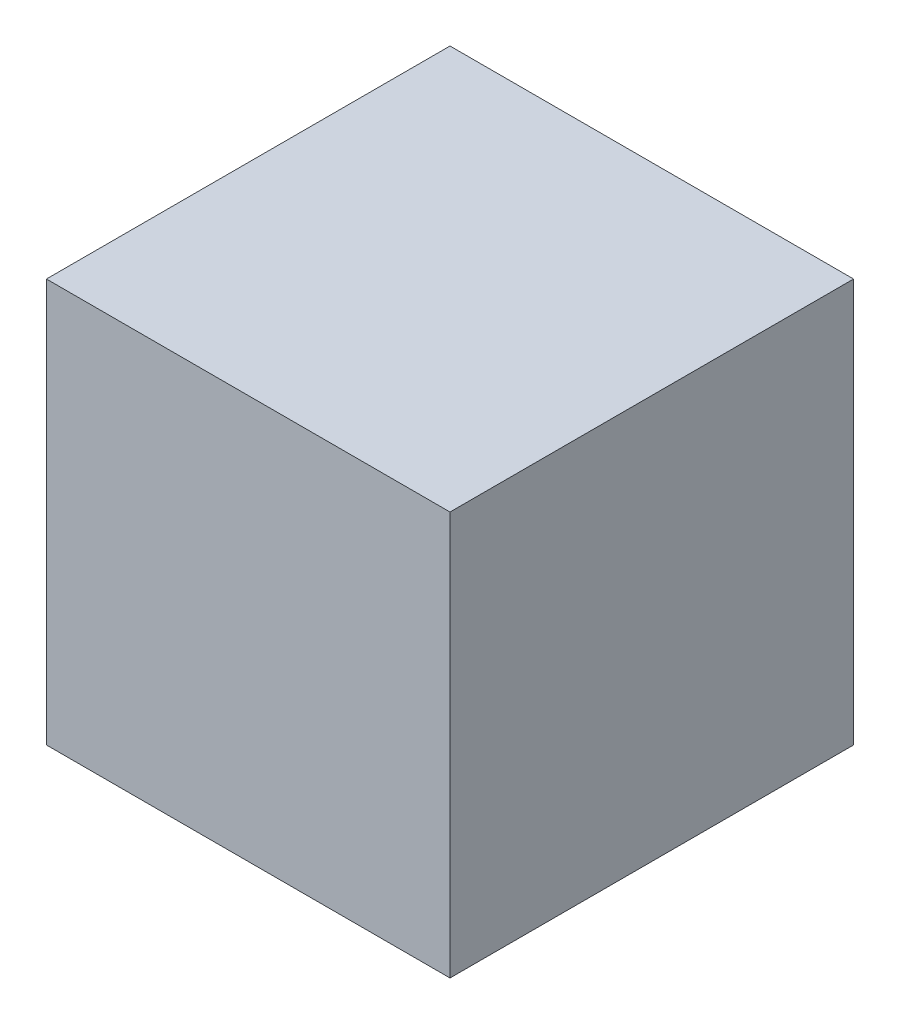
ISO-10303-21;
HEADER;
FILE_DESCRIPTION(('STEP AP214'),'2;1');
FILE_NAME('part.step','',(''),(''),'','','');
FILE_SCHEMA(('AUTOMOTIVE_DESIGN { 1 0 10303 214 1 1 1 1 }'));
ENDSEC;
DATA;
#1=APPLICATION_CONTEXT('core data for automotive mechanical design processes');
#2=APPLICATION_PROTOCOL_DEFINITION('international standard','automotive_design',2000,#1);
#3=PRODUCT_CONTEXT('',#1,'mechanical');
#4=PRODUCT('Part','Part','',(#3));
#5=PRODUCT_RELATED_PRODUCT_CATEGORY('part','',(#4));
#6=PRODUCT_DEFINITION_FORMATION('','',#4);
#7=PRODUCT_DEFINITION_CONTEXT('part definition',#1,'design');
#8=PRODUCT_DEFINITION('design','',#6,#7);
#9=PRODUCT_DEFINITION_SHAPE('','',#8);
#10=(LENGTH_UNIT() NAMED_UNIT(*) SI_UNIT(.MILLI.,.METRE.));
#11=(NAMED_UNIT(*) PLANE_ANGLE_UNIT() SI_UNIT($,.RADIAN.));
#12=(NAMED_UNIT(*) SI_UNIT($,.STERADIAN.) SOLID_ANGLE_UNIT());
#13=UNCERTAINTY_MEASURE_WITH_UNIT(LENGTH_MEASURE(1.E-05),#10,'distance_accuracy_value','');
#14=(GEOMETRIC_REPRESENTATION_CONTEXT(3) GLOBAL_UNCERTAINTY_ASSIGNED_CONTEXT((#13)) GLOBAL_UNIT_ASSIGNED_CONTEXT((#10,
#11,#12)) REPRESENTATION_CONTEXT('',''));
#15=CARTESIAN_POINT('',(0.,0.,0.));
#16=DIRECTION('',(0.,0.,1.));
#17=DIRECTION('',(1.,0.,0.));
#18=AXIS2_PLACEMENT_3D('',#15,#16,#17);
#19=CARTESIAN_POINT('',(-254.000508001016,-254.000508001016,508.001016002032));
#20=DIRECTION('',(-1.,0.,0.));
#21=DIRECTION('',(0.,0.,1.));
#22=AXIS2_PLACEMENT_3D('',#19,#20,#21);
#23=PLANE('',#22);
#24=DIRECTION('',(0.,1.,0.));
#25=VECTOR('',#24,1.);
#26=CARTESIAN_POINT('',(-254.000508001016,-254.000508001016,0.));
#27=LINE('',#26,#25);
#28=CARTESIAN_POINT('',(-254.000508001016,-254.000508001016,0.));
#29=VERTEX_POINT('',#28);
#30=CARTESIAN_POINT('',(-254.000508001016,254.000508001016,0.));
#31=VERTEX_POINT('',#30);
#32=EDGE_CURVE('E102',#29,#31,#27,.T.);
#33=ORIENTED_EDGE('',*,*,#32,.F.);
#34=DIRECTION('',(0.,0.,-1.));
#35=VECTOR('',#34,1.);
#36=CARTESIAN_POINT('',(-254.000508001016,-254.000508001016,508.001016002032));
#37=LINE('',#36,#35);
#38=CARTESIAN_POINT('',(-254.000508001016,-254.000508001016,508.001016002032));
#39=VERTEX_POINT('',#38);
#40=EDGE_CURVE('E11',#39,#29,#37,.T.);
#41=ORIENTED_EDGE('',*,*,#40,.F.);
#42=DIRECTION('',(0.,1.,0.));
#43=VECTOR('',#42,1.);
#44=CARTESIAN_POINT('',(-254.000508001016,-254.000508001016,508.001016002032));
#45=LINE('',#44,#43);
#46=CARTESIAN_POINT('',(-254.000508001016,254.000508001016,508.001016002032));
#47=VERTEX_POINT('',#46);
#48=EDGE_CURVE('E97',#39,#47,#45,.T.);
#49=ORIENTED_EDGE('',*,*,#48,.T.);
#50=DIRECTION('',(0.,0.,-1.));
#51=VECTOR('',#50,1.);
#52=CARTESIAN_POINT('',(-254.000508001016,254.000508001016,508.001016002032));
#53=LINE('',#52,#51);
#54=EDGE_CURVE('E40',#47,#31,#53,.T.);
#55=ORIENTED_EDGE('',*,*,#54,.T.);
#56=EDGE_LOOP('',(#33,#41,#49,#55));
#57=FACE_BOUND('',#56,.T.);
#58=ADVANCED_FACE('F37',(#57),#23,.T.);
#59=CARTESIAN_POINT('',(-254.000508001016,-254.000508001016,508.001016002032));
#60=DIRECTION('',(0.,1.,0.));
#61=DIRECTION('',(0.,0.,1.));
#62=AXIS2_PLACEMENT_3D('',#59,#60,#61);
#63=PLANE('',#62);
#64=DIRECTION('',(1.,0.,0.));
#65=VECTOR('',#64,1.);
#66=CARTESIAN_POINT('',(-254.000508001016,-254.000508001016,0.));
#67=LINE('',#66,#65);
#68=CARTESIAN_POINT('',(254.000508001016,-254.000508001016,0.));
#69=VERTEX_POINT('',#68);
#70=EDGE_CURVE('E70',#29,#69,#67,.T.);
#71=ORIENTED_EDGE('',*,*,#70,.T.);
#72=DIRECTION('',(0.,0.,-1.));
#73=VECTOR('',#72,1.);
#74=CARTESIAN_POINT('',(254.000508001016,-254.000508001016,508.001016002032));
#75=LINE('',#74,#73);
#76=CARTESIAN_POINT('',(254.000508001016,-254.000508001016,508.001016002032));
#77=VERTEX_POINT('',#76);
#78=EDGE_CURVE('E46',#77,#69,#75,.T.);
#79=ORIENTED_EDGE('',*,*,#78,.F.);
#80=DIRECTION('',(1.,0.,0.));
#81=VECTOR('',#80,1.);
#82=CARTESIAN_POINT('',(-254.000508001016,-254.000508001016,508.001016002032));
#83=LINE('',#82,#81);
#84=EDGE_CURVE('E87',#39,#77,#83,.T.);
#85=ORIENTED_EDGE('',*,*,#84,.F.);
#86=ORIENTED_EDGE('',*,*,#40,.T.);
#87=EDGE_LOOP('',(#71,#79,#85,#86));
#88=FACE_BOUND('',#87,.T.);
#89=ADVANCED_FACE('F112',(#88),#63,.F.);
#90=CARTESIAN_POINT('',(254.000508001016,-254.000508001016,508.001016002032));
#91=DIRECTION('',(-1.,0.,0.));
#92=DIRECTION('',(0.,0.,1.));
#93=AXIS2_PLACEMENT_3D('',#90,#91,#92);
#94=PLANE('',#93);
#95=DIRECTION('',(0.,1.,0.));
#96=VECTOR('',#95,1.);
#97=CARTESIAN_POINT('',(254.000508001016,-254.000508001016,0.));
#98=LINE('',#97,#96);
#99=CARTESIAN_POINT('',(254.000508001016,254.000508001016,0.));
#100=VERTEX_POINT('',#99);
#101=EDGE_CURVE('E94',#69,#100,#98,.T.);
#102=ORIENTED_EDGE('',*,*,#101,.T.);
#103=DIRECTION('',(0.,0.,-1.));
#104=VECTOR('',#103,1.);
#105=CARTESIAN_POINT('',(254.000508001016,254.000508001016,508.001016002032));
#106=LINE('',#105,#104);
#107=CARTESIAN_POINT('',(254.000508001016,254.000508001016,508.001016002032));
#108=VERTEX_POINT('',#107);
#109=EDGE_CURVE('E91',#108,#100,#106,.T.);
#110=ORIENTED_EDGE('',*,*,#109,.F.);
#111=DIRECTION('',(0.,1.,0.));
#112=VECTOR('',#111,1.);
#113=CARTESIAN_POINT('',(254.000508001016,-254.000508001016,508.001016002032));
#114=LINE('',#113,#112);
#115=EDGE_CURVE('E82',#77,#108,#114,.T.);
#116=ORIENTED_EDGE('',*,*,#115,.F.);
#117=ORIENTED_EDGE('',*,*,#78,.T.);
#118=EDGE_LOOP('',(#102,#110,#116,#117));
#119=FACE_BOUND('',#118,.T.);
#120=ADVANCED_FACE('F92',(#119),#94,.F.);
#121=CARTESIAN_POINT('',(-254.000508001016,254.000508001016,508.001016002032));
#122=DIRECTION('',(0.,1.,0.));
#123=DIRECTION('',(0.,0.,1.));
#124=AXIS2_PLACEMENT_3D('',#121,#122,#123);
#125=PLANE('',#124);
#126=DIRECTION('',(1.,0.,0.));
#127=VECTOR('',#126,1.);
#128=CARTESIAN_POINT('',(-254.000508001016,254.000508001016,0.));
#129=LINE('',#128,#127);
#130=EDGE_CURVE('E105',#31,#100,#129,.T.);
#131=ORIENTED_EDGE('',*,*,#130,.F.);
#132=ORIENTED_EDGE('',*,*,#54,.F.);
#133=DIRECTION('',(1.,0.,0.));
#134=VECTOR('',#133,1.);
#135=CARTESIAN_POINT('',(-254.000508001016,254.000508001016,508.001016002032));
#136=LINE('',#135,#134);
#137=EDGE_CURVE('E86',#47,#108,#136,.T.);
#138=ORIENTED_EDGE('',*,*,#137,.T.);
#139=ORIENTED_EDGE('',*,*,#109,.T.);
#140=EDGE_LOOP('',(#131,#132,#138,#139));
#141=FACE_BOUND('',#140,.T.);
#142=ADVANCED_FACE('F96',(#141),#125,.T.);
#143=CARTESIAN_POINT('',(0.,0.,508.001016002032));
#144=DIRECTION('',(0.,0.,-1.));
#145=DIRECTION('',(-1.,0.,0.));
#146=AXIS2_PLACEMENT_3D('',#143,#144,#145);
#147=PLANE('',#146);
#148=ORIENTED_EDGE('',*,*,#48,.F.);
#149=ORIENTED_EDGE('',*,*,#84,.T.);
#150=ORIENTED_EDGE('',*,*,#115,.T.);
#151=ORIENTED_EDGE('',*,*,#137,.F.);
#152=EDGE_LOOP('',(#148,#149,#150,#151));
#153=FACE_BOUND('',#152,.T.);
#154=ADVANCED_FACE('F85',(#153),#147,.F.);
#155=CARTESIAN_POINT('',(0.,0.,0.));
#156=DIRECTION('',(0.,0.,-1.));
#157=DIRECTION('',(-1.,0.,0.));
#158=AXIS2_PLACEMENT_3D('',#155,#156,#157);
#159=PLANE('',#158);
#160=ORIENTED_EDGE('',*,*,#32,.T.);
#161=ORIENTED_EDGE('',*,*,#130,.T.);
#162=ORIENTED_EDGE('',*,*,#101,.F.);
#163=ORIENTED_EDGE('',*,*,#70,.F.);
#164=EDGE_LOOP('',(#160,#161,#162,#163));
#165=FACE_BOUND('',#164,.T.);
#166=ADVANCED_FACE('F110',(#165),#159,.T.);
#167=CLOSED_SHELL('',(#58,#89,#120,#142,#154,#166));
#168=MANIFOLD_SOLID_BREP('B2',#167);
#169=ADVANCED_BREP_SHAPE_REPRESENTATION('',(#18,#168),#14);
#170=SHAPE_DEFINITION_REPRESENTATION(#9,#169);
ENDSEC;
END-ISO-10303-21;
